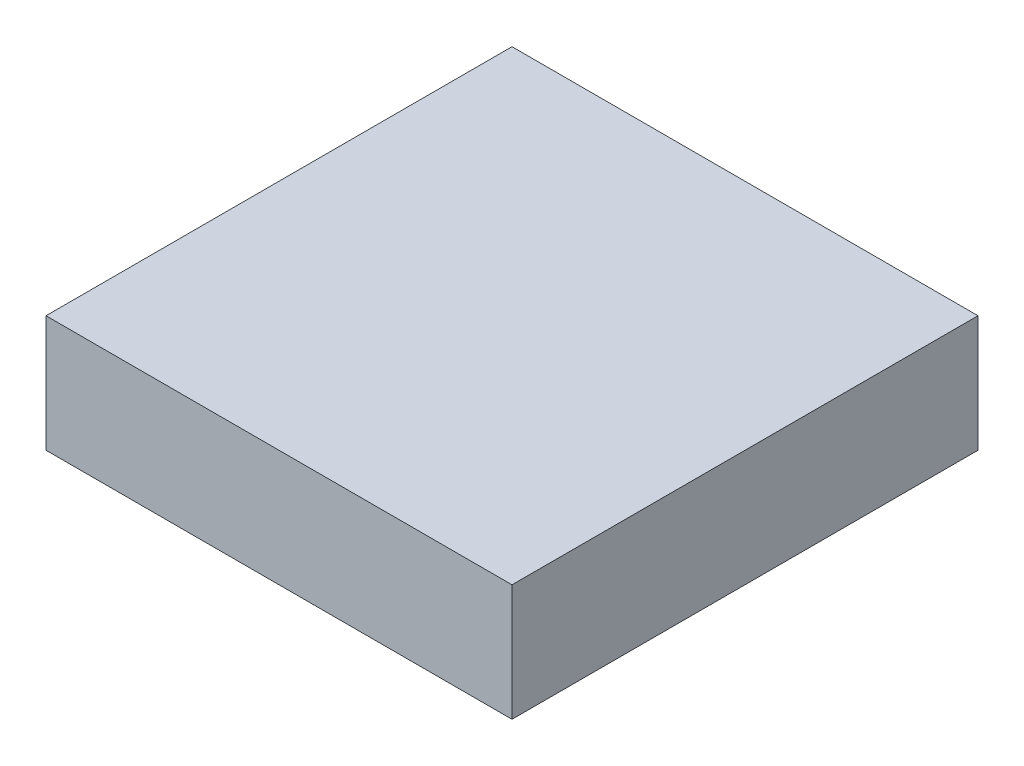
ISO-10303-21;
HEADER;
FILE_DESCRIPTION(('STEP AP214'),'2;1');
FILE_NAME('part.step','',(''),(''),'','','');
FILE_SCHEMA(('AUTOMOTIVE_DESIGN { 1 0 10303 214 1 1 1 1 }'));
ENDSEC;
DATA;
#1=APPLICATION_CONTEXT('core data for automotive mechanical design processes');
#2=APPLICATION_PROTOCOL_DEFINITION('international standard','automotive_design',2000,#1);
#3=PRODUCT_CONTEXT('',#1,'mechanical');
#4=PRODUCT('Part','Part','',(#3));
#5=PRODUCT_RELATED_PRODUCT_CATEGORY('part','',(#4));
#6=PRODUCT_DEFINITION_FORMATION('','',#4);
#7=PRODUCT_DEFINITION_CONTEXT('part definition',#1,'design');
#8=PRODUCT_DEFINITION('design','',#6,#7);
#9=PRODUCT_DEFINITION_SHAPE('','',#8);
#10=(LENGTH_UNIT() NAMED_UNIT(*) SI_UNIT(.MILLI.,.METRE.));
#11=(NAMED_UNIT(*) PLANE_ANGLE_UNIT() SI_UNIT($,.RADIAN.));
#12=(NAMED_UNIT(*) SI_UNIT($,.STERADIAN.) SOLID_ANGLE_UNIT());
#13=UNCERTAINTY_MEASURE_WITH_UNIT(LENGTH_MEASURE(1.E-05),#10,'distance_accuracy_value','');
#14=(GEOMETRIC_REPRESENTATION_CONTEXT(3) GLOBAL_UNCERTAINTY_ASSIGNED_CONTEXT((#13)) GLOBAL_UNIT_ASSIGNED_CONTEXT((#10,
#11,#12)) REPRESENTATION_CONTEXT('',''));
#15=CARTESIAN_POINT('',(0.,0.,0.));
#16=DIRECTION('',(0.,0.,1.));
#17=DIRECTION('',(1.,0.,0.));
#18=AXIS2_PLACEMENT_3D('',#15,#16,#17);
#19=CARTESIAN_POINT('',(0.,76.2,0.));
#20=DIRECTION('',(0.,-1.,0.));
#21=DIRECTION('',(0.,0.,1.));
#22=AXIS2_PLACEMENT_3D('',#19,#20,#21);
#23=PLANE('',#22);
#24=DIRECTION('',(1.,0.,0.));
#25=VECTOR('',#24,1.);
#26=CARTESIAN_POINT('',(-505.459999999999,76.2,-1013.46));
#27=LINE('',#26,#25);
#28=CARTESIAN_POINT('',(-505.459999999999,76.2,-1013.46));
#29=VERTEX_POINT('',#28);
#30=CARTESIAN_POINT('',(-429.259999999999,76.2,-1013.46));
#31=VERTEX_POINT('',#30);
#32=EDGE_CURVE('E107',#29,#31,#27,.T.);
#33=ORIENTED_EDGE('',*,*,#32,.F.);
#34=DIRECTION('',(0.,0.,-1.));
#35=VECTOR('',#34,1.);
#36=CARTESIAN_POINT('',(-505.459999999999,76.2,-1013.46));
#37=LINE('',#36,#35);
#38=CARTESIAN_POINT('',(-505.459999999999,76.2,-937.26));
#39=VERTEX_POINT('',#38);
#40=EDGE_CURVE('E71',#39,#29,#37,.T.);
#41=ORIENTED_EDGE('',*,*,#40,.F.);
#42=DIRECTION('',(-1.,0.,0.));
#43=VECTOR('',#42,1.);
#44=CARTESIAN_POINT('',(-505.459999999999,76.2,-937.26));
#45=LINE('',#44,#43);
#46=CARTESIAN_POINT('',(-429.26,76.2,-937.26));
#47=VERTEX_POINT('',#46);
#48=EDGE_CURVE('E104',#47,#39,#45,.T.);
#49=ORIENTED_EDGE('',*,*,#48,.F.);
#50=DIRECTION('',(0.,0.,1.));
#51=VECTOR('',#50,1.);
#52=CARTESIAN_POINT('',(-429.26,76.2,-937.26));
#53=LINE('',#52,#51);
#54=EDGE_CURVE('E98',#31,#47,#53,.T.);
#55=ORIENTED_EDGE('',*,*,#54,.F.);
#56=EDGE_LOOP('',(#33,#41,#49,#55));
#57=FACE_BOUND('',#56,.T.);
#58=ADVANCED_FACE('F38',(#57),#23,.F.);
#59=CARTESIAN_POINT('',(-505.459999999999,57.15,-1013.46));
#60=DIRECTION('',(1.,0.,0.));
#61=DIRECTION('',(0.,0.,-1.));
#62=AXIS2_PLACEMENT_3D('',#59,#60,#61);
#63=PLANE('',#62);
#64=ORIENTED_EDGE('',*,*,#40,.T.);
#65=DIRECTION('',(0.,1.,0.));
#66=VECTOR('',#65,1.);
#67=CARTESIAN_POINT('',(-505.459999999999,57.15,-1013.46));
#68=LINE('',#67,#66);
#69=CARTESIAN_POINT('',(-505.459999999999,57.15,-1013.46));
#70=VERTEX_POINT('',#69);
#71=EDGE_CURVE('E99',#70,#29,#68,.T.);
#72=ORIENTED_EDGE('',*,*,#71,.F.);
#73=DIRECTION('',(0.,0.,-1.));
#74=VECTOR('',#73,1.);
#75=CARTESIAN_POINT('',(-505.459999999999,57.15,-1013.46));
#76=LINE('',#75,#74);
#77=CARTESIAN_POINT('',(-505.459999999999,57.15,-937.26));
#78=VERTEX_POINT('',#77);
#79=EDGE_CURVE('E55',#78,#70,#76,.T.);
#80=ORIENTED_EDGE('',*,*,#79,.F.);
#81=DIRECTION('',(0.,1.,0.));
#82=VECTOR('',#81,1.);
#83=CARTESIAN_POINT('',(-505.459999999999,57.15,-937.26));
#84=LINE('',#83,#82);
#85=EDGE_CURVE('E90',#78,#39,#84,.T.);
#86=ORIENTED_EDGE('',*,*,#85,.T.);
#87=EDGE_LOOP('',(#64,#72,#80,#86));
#88=FACE_BOUND('',#87,.T.);
#89=ADVANCED_FACE('F113',(#88),#63,.F.);
#90=CARTESIAN_POINT('',(-505.459999999999,57.15,-1013.46));
#91=DIRECTION('',(0.,0.,1.));
#92=DIRECTION('',(1.,0.,0.));
#93=AXIS2_PLACEMENT_3D('',#90,#91,#92);
#94=PLANE('',#93);
#95=ORIENTED_EDGE('',*,*,#32,.T.);
#96=DIRECTION('',(0.,1.,0.));
#97=VECTOR('',#96,1.);
#98=CARTESIAN_POINT('',(-429.259999999999,57.15,-1013.46));
#99=LINE('',#98,#97);
#100=CARTESIAN_POINT('',(-429.259999999999,57.15,-1013.46));
#101=VERTEX_POINT('',#100);
#102=EDGE_CURVE('E11',#101,#31,#99,.T.);
#103=ORIENTED_EDGE('',*,*,#102,.F.);
#104=DIRECTION('',(1.,0.,0.));
#105=VECTOR('',#104,1.);
#106=CARTESIAN_POINT('',(-505.459999999999,57.15,-1013.46));
#107=LINE('',#106,#105);
#108=EDGE_CURVE('E94',#70,#101,#107,.T.);
#109=ORIENTED_EDGE('',*,*,#108,.F.);
#110=ORIENTED_EDGE('',*,*,#71,.T.);
#111=EDGE_LOOP('',(#95,#103,#109,#110));
#112=FACE_BOUND('',#111,.T.);
#113=ADVANCED_FACE('F40',(#112),#94,.F.);
#114=CARTESIAN_POINT('',(0.,57.15,0.));
#115=DIRECTION('',(0.,-1.,0.));
#116=DIRECTION('',(0.,0.,1.));
#117=AXIS2_PLACEMENT_3D('',#114,#115,#116);
#118=PLANE('',#117);
#119=ORIENTED_EDGE('',*,*,#108,.T.);
#120=DIRECTION('',(0.,0.,1.));
#121=VECTOR('',#120,1.);
#122=CARTESIAN_POINT('',(-429.259999999999,57.15,-1013.46));
#123=LINE('',#122,#121);
#124=CARTESIAN_POINT('',(-429.26,57.15,-937.26));
#125=VERTEX_POINT('',#124);
#126=EDGE_CURVE('E81',#101,#125,#123,.T.);
#127=ORIENTED_EDGE('',*,*,#126,.T.);
#128=DIRECTION('',(-1.,0.,0.));
#129=VECTOR('',#128,1.);
#130=CARTESIAN_POINT('',(-429.26,57.15,-937.26));
#131=LINE('',#130,#129);
#132=EDGE_CURVE('E86',#125,#78,#131,.T.);
#133=ORIENTED_EDGE('',*,*,#132,.T.);
#134=ORIENTED_EDGE('',*,*,#79,.T.);
#135=EDGE_LOOP('',(#119,#127,#133,#134));
#136=FACE_BOUND('',#135,.T.);
#137=ADVANCED_FACE('F92',(#136),#118,.T.);
#138=CARTESIAN_POINT('',(-505.459999999999,57.15,-937.26));
#139=DIRECTION('',(0.,0.,-1.));
#140=DIRECTION('',(-1.,0.,0.));
#141=AXIS2_PLACEMENT_3D('',#138,#139,#140);
#142=PLANE('',#141);
#143=ORIENTED_EDGE('',*,*,#48,.T.);
#144=ORIENTED_EDGE('',*,*,#85,.F.);
#145=ORIENTED_EDGE('',*,*,#132,.F.);
#146=DIRECTION('',(0.,1.,0.));
#147=VECTOR('',#146,1.);
#148=CARTESIAN_POINT('',(-429.26,57.15,-937.26));
#149=LINE('',#148,#147);
#150=EDGE_CURVE('E47',#125,#47,#149,.T.);
#151=ORIENTED_EDGE('',*,*,#150,.T.);
#152=EDGE_LOOP('',(#143,#144,#145,#151));
#153=FACE_BOUND('',#152,.T.);
#154=ADVANCED_FACE('F88',(#153),#142,.F.);
#155=CARTESIAN_POINT('',(-429.26,57.15,-937.26));
#156=DIRECTION('',(-1.,0.,0.));
#157=DIRECTION('',(0.,0.,1.));
#158=AXIS2_PLACEMENT_3D('',#155,#156,#157);
#159=PLANE('',#158);
#160=ORIENTED_EDGE('',*,*,#54,.T.);
#161=ORIENTED_EDGE('',*,*,#150,.F.);
#162=ORIENTED_EDGE('',*,*,#126,.F.);
#163=ORIENTED_EDGE('',*,*,#102,.T.);
#164=EDGE_LOOP('',(#160,#161,#162,#163));
#165=FACE_BOUND('',#164,.T.);
#166=ADVANCED_FACE('F97',(#165),#159,.F.);
#167=CLOSED_SHELL('',(#58,#89,#113,#137,#154,#166));
#168=MANIFOLD_SOLID_BREP('B2',#167);
#169=ADVANCED_BREP_SHAPE_REPRESENTATION('',(#18,#168),#14);
#170=SHAPE_DEFINITION_REPRESENTATION(#9,#169);
ENDSEC;
END-ISO-10303-21;
